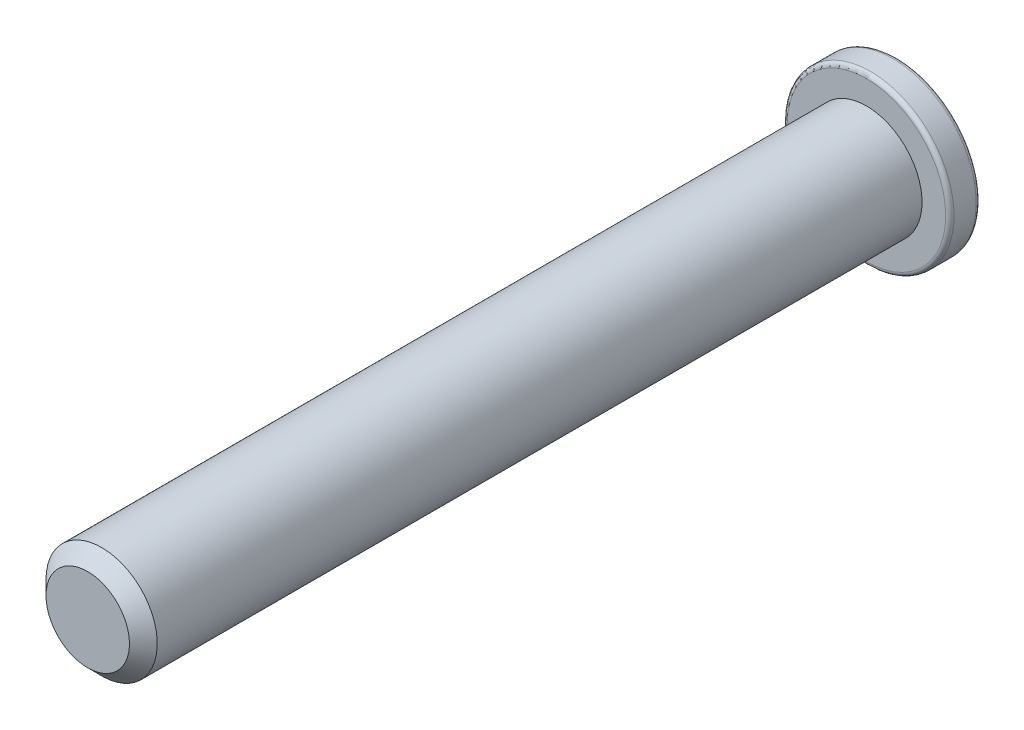
ISO-10303-21;
HEADER;
FILE_DESCRIPTION(('STEP AP214'),'2;1');
FILE_NAME('part.step','',(''),(''),'','','');
FILE_SCHEMA(('AUTOMOTIVE_DESIGN { 1 0 10303 214 1 1 1 1 }'));
ENDSEC;
DATA;
#1=APPLICATION_CONTEXT('core data for automotive mechanical design processes');
#2=APPLICATION_PROTOCOL_DEFINITION('international standard','automotive_design',2000,#1);
#3=PRODUCT_CONTEXT('',#1,'mechanical');
#4=PRODUCT('Part','Part','',(#3));
#5=PRODUCT_RELATED_PRODUCT_CATEGORY('part','',(#4));
#6=PRODUCT_DEFINITION_FORMATION('','',#4);
#7=PRODUCT_DEFINITION_CONTEXT('part definition',#1,'design');
#8=PRODUCT_DEFINITION('design','',#6,#7);
#9=PRODUCT_DEFINITION_SHAPE('','',#8);
#10=(LENGTH_UNIT() NAMED_UNIT(*) SI_UNIT(.MILLI.,.METRE.));
#11=(NAMED_UNIT(*) PLANE_ANGLE_UNIT() SI_UNIT($,.RADIAN.));
#12=(NAMED_UNIT(*) SI_UNIT($,.STERADIAN.) SOLID_ANGLE_UNIT());
#13=UNCERTAINTY_MEASURE_WITH_UNIT(LENGTH_MEASURE(1.E-05),#10,'distance_accuracy_value','');
#14=(GEOMETRIC_REPRESENTATION_CONTEXT(3) GLOBAL_UNCERTAINTY_ASSIGNED_CONTEXT((#13)) GLOBAL_UNIT_ASSIGNED_CONTEXT((#10,
#11,#12)) REPRESENTATION_CONTEXT('',''));
#15=CARTESIAN_POINT('',(0.,0.,0.));
#16=DIRECTION('',(0.,0.,1.));
#17=DIRECTION('',(1.,0.,0.));
#18=AXIS2_PLACEMENT_3D('',#15,#16,#17);
#19=CARTESIAN_POINT('',(12.09999928,11.25,-18.9584026755113));
#20=DIRECTION('',(-0.923879532511287,0.,-0.38268343236509));
#21=DIRECTION('',(-0.38268343236509,0.,0.923879532511287));
#22=AXIS2_PLACEMENT_3D('',#19,#20,#21);
#23=PLANE('',#22);
#24=DIRECTION('',(0.,1.,0.));
#25=VECTOR('',#24,1.);
#26=CARTESIAN_POINT('',(11.6029430051523,11.25,-17.7584026755113));
#27=LINE('',#26,#25);
#28=CARTESIAN_POINT('',(11.6029430051523,11.1339121743322,-17.7584026755113));
#29=VERTEX_POINT('',#28);
#30=CARTESIAN_POINT('',(11.6029430051523,11.3660878256678,-17.7584026755113));
#31=VERTEX_POINT('',#30);
#32=EDGE_CURVE('E117',#29,#31,#27,.T.);
#33=ORIENTED_EDGE('',*,*,#32,.T.);
#34=DIRECTION('',(-0.381887326256781,-0.0644695530821724,0.921957562347547));
#35=VECTOR('',#34,1.);
#36=CARTESIAN_POINT('',(12.09999928,11.45,-18.9584026755113));
#37=LINE('',#36,#35);
#38=CARTESIAN_POINT('',(12.09999928,11.45,-18.9584026755113));
#39=VERTEX_POINT('',#38);
#40=EDGE_CURVE('E133',#39,#31,#37,.T.);
#41=ORIENTED_EDGE('',*,*,#40,.F.);
#42=DIRECTION('',(0.,1.,0.));
#43=VECTOR('',#42,1.);
#44=CARTESIAN_POINT('',(12.09999928,11.25,-18.9584026755113));
#45=LINE('',#44,#43);
#46=CARTESIAN_POINT('',(12.09999928,11.05,-18.9584026755113));
#47=VERTEX_POINT('',#46);
#48=EDGE_CURVE('E122',#39,#47,#45,.F.);
#49=ORIENTED_EDGE('',*,*,#48,.T.);
#50=DIRECTION('',(0.381887326256781,-0.0644695530821737,-0.921957562347547));
#51=VECTOR('',#50,1.);
#52=CARTESIAN_POINT('',(11.6029430051523,11.1339121743322,-17.7584026755113));
#53=LINE('',#52,#51);
#54=EDGE_CURVE('E286',#29,#47,#53,.T.);
#55=ORIENTED_EDGE('',*,*,#54,.F.);
#56=EDGE_LOOP('',(#33,#41,#49,#55));
#57=FACE_BOUND('',#56,.T.);
#58=ADVANCED_FACE('F17',(#57),#23,.T.);
#59=CARTESIAN_POINT('',(11.24999928,11.45,-18.9584026755113));
#60=DIRECTION('',(0.,-0.997564050259824,-0.0697564737441253));
#61=DIRECTION('',(0.,0.0697564737441253,-0.997564050259824));
#62=AXIS2_PLACEMENT_3D('',#59,#60,#61);
#63=PLANE('',#62);
#64=DIRECTION('',(1.,0.,0.));
#65=VECTOR('',#64,1.);
#66=CARTESIAN_POINT('',(11.24999928,11.3660878256678,-17.7584026755113));
#67=LINE('',#66,#65);
#68=CARTESIAN_POINT('',(11.3660871056678,11.3660878256678,-17.7584026755113));
#69=VERTEX_POINT('',#68);
#70=EDGE_CURVE('E135',#31,#69,#67,.F.);
#71=ORIENTED_EDGE('',*,*,#70,.T.);
#72=DIRECTION('',(-0.0695873743166642,-0.0695873743166541,0.995145815783509));
#73=VECTOR('',#72,1.);
#74=CARTESIAN_POINT('',(11.44999928,11.45,-18.9584026755113));
#75=LINE('',#74,#73);
#76=CARTESIAN_POINT('',(11.44999928,11.45,-18.9584026755113));
#77=VERTEX_POINT('',#76);
#78=EDGE_CURVE('E139',#77,#69,#75,.T.);
#79=ORIENTED_EDGE('',*,*,#78,.F.);
#80=DIRECTION('',(1.,0.,0.));
#81=VECTOR('',#80,1.);
#82=CARTESIAN_POINT('',(11.24999928,11.45,-18.9584026755113));
#83=LINE('',#82,#81);
#84=EDGE_CURVE('E126',#77,#39,#83,.T.);
#85=ORIENTED_EDGE('',*,*,#84,.T.);
#86=ORIENTED_EDGE('',*,*,#40,.T.);
#87=EDGE_LOOP('',(#71,#79,#85,#86));
#88=FACE_BOUND('',#87,.T.);
#89=ADVANCED_FACE('F137',(#88),#63,.T.);
#90=CARTESIAN_POINT('',(11.24999928,11.05,-18.9584026755113));
#91=DIRECTION('',(0.,0.997564050259824,-0.0697564737441253));
#92=DIRECTION('',(0.,0.0697564737441253,0.997564050259824));
#93=AXIS2_PLACEMENT_3D('',#90,#91,#92);
#94=PLANE('',#93);
#95=DIRECTION('',(1.,0.,0.));
#96=VECTOR('',#95,1.);
#97=CARTESIAN_POINT('',(11.24999928,11.1339121743322,-17.7584026755113));
#98=LINE('',#97,#96);
#99=CARTESIAN_POINT('',(11.3660871056678,11.1339121743322,-17.7584026755113));
#100=VERTEX_POINT('',#99);
#101=EDGE_CURVE('E288',#100,#29,#98,.T.);
#102=ORIENTED_EDGE('',*,*,#101,.T.);
#103=ORIENTED_EDGE('',*,*,#54,.T.);
#104=DIRECTION('',(1.,0.,0.));
#105=VECTOR('',#104,1.);
#106=CARTESIAN_POINT('',(11.24999928,11.05,-18.9584026755113));
#107=LINE('',#106,#105);
#108=CARTESIAN_POINT('',(11.44999928,11.05,-18.9584026755113));
#109=VERTEX_POINT('',#108);
#110=EDGE_CURVE('E129',#47,#109,#107,.F.);
#111=ORIENTED_EDGE('',*,*,#110,.T.);
#112=DIRECTION('',(0.0695873743166642,-0.0695873743166541,-0.995145815783509));
#113=VECTOR('',#112,1.);
#114=CARTESIAN_POINT('',(11.3660871056678,11.1339121743322,-17.7584026755113));
#115=LINE('',#114,#113);
#116=EDGE_CURVE('E272',#100,#109,#115,.T.);
#117=ORIENTED_EDGE('',*,*,#116,.F.);
#118=EDGE_LOOP('',(#102,#103,#111,#117));
#119=FACE_BOUND('',#118,.T.);
#120=ADVANCED_FACE('F459',(#119),#94,.T.);
#121=CARTESIAN_POINT('',(11.44999928,11.25,-18.9584026755113));
#122=DIRECTION('',(-0.997564050259824,0.,-0.0697564737441253));
#123=DIRECTION('',(-0.0697564737441253,0.,0.997564050259824));
#124=AXIS2_PLACEMENT_3D('',#121,#122,#123);
#125=PLANE('',#124);
#126=DIRECTION('',(0.,1.,0.));
#127=VECTOR('',#126,1.);
#128=CARTESIAN_POINT('',(11.3660871056678,11.25,-17.7584026755113));
#129=LINE('',#128,#127);
#130=CARTESIAN_POINT('',(11.3660871056678,11.6029437251523,-17.7584026755113));
#131=VERTEX_POINT('',#130);
#132=EDGE_CURVE('E281',#69,#131,#129,.T.);
#133=ORIENTED_EDGE('',*,*,#132,.T.);
#134=DIRECTION('',(-0.0644695530821645,-0.381887326256792,0.921957562347544));
#135=VECTOR('',#134,1.);
#136=CARTESIAN_POINT('',(11.44999928,12.1,-18.9584026755113));
#137=LINE('',#136,#135);
#138=CARTESIAN_POINT('',(11.44999928,12.1,-18.9584026755113));
#139=VERTEX_POINT('',#138);
#140=EDGE_CURVE('E266',#139,#131,#137,.T.);
#141=ORIENTED_EDGE('',*,*,#140,.F.);
#142=DIRECTION('',(0.,1.,0.));
#143=VECTOR('',#142,1.);
#144=CARTESIAN_POINT('',(11.44999928,11.25,-18.9584026755113));
#145=LINE('',#144,#143);
#146=EDGE_CURVE('E284',#139,#77,#145,.F.);
#147=ORIENTED_EDGE('',*,*,#146,.T.);
#148=ORIENTED_EDGE('',*,*,#78,.T.);
#149=EDGE_LOOP('',(#133,#141,#147,#148));
#150=FACE_BOUND('',#149,.T.);
#151=ADVANCED_FACE('F298',(#150),#125,.T.);
#152=CARTESIAN_POINT('',(11.44999928,11.25,-18.9584026755113));
#153=DIRECTION('',(-0.997564050259824,0.,-0.0697564737441253));
#154=DIRECTION('',(-0.0697564737441253,0.,0.997564050259824));
#155=AXIS2_PLACEMENT_3D('',#152,#153,#154);
#156=PLANE('',#155);
#157=DIRECTION('',(0.,1.,0.));
#158=VECTOR('',#157,1.);
#159=CARTESIAN_POINT('',(11.3660871056678,11.25,-17.7584026755113));
#160=LINE('',#159,#158);
#161=CARTESIAN_POINT('',(11.3660871056678,10.8970562748477,-17.7584026755113));
#162=VERTEX_POINT('',#161);
#163=EDGE_CURVE('E275',#162,#100,#160,.T.);
#164=ORIENTED_EDGE('',*,*,#163,.T.);
#165=ORIENTED_EDGE('',*,*,#116,.T.);
#166=DIRECTION('',(0.,1.,0.));
#167=VECTOR('',#166,1.);
#168=CARTESIAN_POINT('',(11.44999928,11.25,-18.9584026755113));
#169=LINE('',#168,#167);
#170=CARTESIAN_POINT('',(11.44999928,10.4,-18.9584026755113));
#171=VERTEX_POINT('',#170);
#172=EDGE_CURVE('E278',#109,#171,#169,.F.);
#173=ORIENTED_EDGE('',*,*,#172,.T.);
#174=DIRECTION('',(0.0644695530821645,-0.381887326256792,-0.921957562347544));
#175=VECTOR('',#174,1.);
#176=CARTESIAN_POINT('',(11.3660871056678,10.8970562748477,-17.7584026755113));
#177=LINE('',#176,#175);
#178=EDGE_CURVE('E255',#162,#171,#177,.T.);
#179=ORIENTED_EDGE('',*,*,#178,.F.);
#180=EDGE_LOOP('',(#164,#165,#173,#179));
#181=FACE_BOUND('',#180,.T.);
#182=ADVANCED_FACE('F445',(#181),#156,.T.);
#183=CARTESIAN_POINT('',(11.24999928,12.1,-18.9584026755113));
#184=DIRECTION('',(0.,-0.923879532511287,-0.38268343236509));
#185=DIRECTION('',(0.,0.38268343236509,-0.923879532511287));
#186=AXIS2_PLACEMENT_3D('',#183,#184,#185);
#187=PLANE('',#186);
#188=DIRECTION('',(1.,0.,0.));
#189=VECTOR('',#188,1.);
#190=CARTESIAN_POINT('',(11.24999928,11.6029437251523,-17.7584026755113));
#191=LINE('',#190,#189);
#192=CARTESIAN_POINT('',(11.1339114543322,11.6029437251523,-17.7584026755113));
#193=VERTEX_POINT('',#192);
#194=EDGE_CURVE('E264',#131,#193,#191,.F.);
#195=ORIENTED_EDGE('',*,*,#194,.T.);
#196=DIRECTION('',(0.0644695530821724,-0.38188732625678,0.921957562347548));
#197=VECTOR('',#196,1.);
#198=CARTESIAN_POINT('',(11.04999928,12.1,-18.9584026755113));
#199=LINE('',#198,#197);
#200=CARTESIAN_POINT('',(11.04999928,12.1,-18.9584026755113));
#201=VERTEX_POINT('',#200);
#202=EDGE_CURVE('E249',#201,#193,#199,.T.);
#203=ORIENTED_EDGE('',*,*,#202,.F.);
#204=DIRECTION('',(1.,0.,0.));
#205=VECTOR('',#204,1.);
#206=CARTESIAN_POINT('',(11.24999928,12.1,-18.9584026755113));
#207=LINE('',#206,#205);
#208=EDGE_CURVE('E269',#201,#139,#207,.T.);
#209=ORIENTED_EDGE('',*,*,#208,.T.);
#210=ORIENTED_EDGE('',*,*,#140,.T.);
#211=EDGE_LOOP('',(#195,#203,#209,#210));
#212=FACE_BOUND('',#211,.T.);
#213=ADVANCED_FACE('F302',(#212),#187,.T.);
#214=CARTESIAN_POINT('',(11.24999928,10.4,-18.9584026755113));
#215=DIRECTION('',(0.,0.923879532511287,-0.38268343236509));
#216=DIRECTION('',(0.,0.38268343236509,0.923879532511287));
#217=AXIS2_PLACEMENT_3D('',#214,#215,#216);
#218=PLANE('',#217);
#219=DIRECTION('',(1.,0.,0.));
#220=VECTOR('',#219,1.);
#221=CARTESIAN_POINT('',(11.24999928,10.8970562748477,-17.7584026755113));
#222=LINE('',#221,#220);
#223=CARTESIAN_POINT('',(11.1339114543322,10.8970562748477,-17.7584026755113));
#224=VERTEX_POINT('',#223);
#225=EDGE_CURVE('E258',#224,#162,#222,.T.);
#226=ORIENTED_EDGE('',*,*,#225,.T.);
#227=ORIENTED_EDGE('',*,*,#178,.T.);
#228=DIRECTION('',(1.,0.,0.));
#229=VECTOR('',#228,1.);
#230=CARTESIAN_POINT('',(11.24999928,10.4,-18.9584026755113));
#231=LINE('',#230,#229);
#232=CARTESIAN_POINT('',(11.04999928,10.4,-18.9584026755113));
#233=VERTEX_POINT('',#232);
#234=EDGE_CURVE('E261',#171,#233,#231,.F.);
#235=ORIENTED_EDGE('',*,*,#234,.T.);
#236=DIRECTION('',(-0.0644695530821738,-0.381887326256779,-0.921957562347548));
#237=VECTOR('',#236,1.);
#238=CARTESIAN_POINT('',(11.1339114543322,10.8970562748477,-17.7584026755113));
#239=LINE('',#238,#237);
#240=EDGE_CURVE('E241',#224,#233,#239,.T.);
#241=ORIENTED_EDGE('',*,*,#240,.F.);
#242=EDGE_LOOP('',(#226,#227,#235,#241));
#243=FACE_BOUND('',#242,.T.);
#244=ADVANCED_FACE('F431',(#243),#218,.T.);
#245=CARTESIAN_POINT('',(11.04999928,11.25,-18.9584026755113));
#246=DIRECTION('',(0.997564050259824,0.,-0.0697564737441253));
#247=DIRECTION('',(-0.0697564737441253,0.,-0.997564050259824));
#248=AXIS2_PLACEMENT_3D('',#245,#246,#247);
#249=PLANE('',#248);
#250=DIRECTION('',(0.,1.,0.));
#251=VECTOR('',#250,1.);
#252=CARTESIAN_POINT('',(11.1339114543322,11.25,-17.7584026755113));
#253=LINE('',#252,#251);
#254=CARTESIAN_POINT('',(11.1339114543322,11.3660878256678,-17.7584026755113));
#255=VERTEX_POINT('',#254);
#256=EDGE_CURVE('E247',#193,#255,#253,.F.);
#257=ORIENTED_EDGE('',*,*,#256,.T.);
#258=DIRECTION('',(0.0695873743166541,-0.0695873743166642,0.995145815783509));
#259=VECTOR('',#258,1.);
#260=CARTESIAN_POINT('',(11.04999928,11.45,-18.9584026755113));
#261=LINE('',#260,#259);
#262=CARTESIAN_POINT('',(11.04999928,11.45,-18.9584026755113));
#263=VERTEX_POINT('',#262);
#264=EDGE_CURVE('E235',#263,#255,#261,.T.);
#265=ORIENTED_EDGE('',*,*,#264,.F.);
#266=DIRECTION('',(0.,1.,0.));
#267=VECTOR('',#266,1.);
#268=CARTESIAN_POINT('',(11.04999928,11.25,-18.9584026755113));
#269=LINE('',#268,#267);
#270=EDGE_CURVE('E252',#263,#201,#269,.T.);
#271=ORIENTED_EDGE('',*,*,#270,.T.);
#272=ORIENTED_EDGE('',*,*,#202,.T.);
#273=EDGE_LOOP('',(#257,#265,#271,#272));
#274=FACE_BOUND('',#273,.T.);
#275=ADVANCED_FACE('F304',(#274),#249,.T.);
#276=CARTESIAN_POINT('',(11.04999928,11.25,-18.9584026755113));
#277=DIRECTION('',(0.997564050259824,0.,-0.0697564737441253));
#278=DIRECTION('',(-0.0697564737441253,0.,-0.997564050259824));
#279=AXIS2_PLACEMENT_3D('',#276,#277,#278);
#280=PLANE('',#279);
#281=DIRECTION('',(0.,1.,0.));
#282=VECTOR('',#281,1.);
#283=CARTESIAN_POINT('',(11.1339114543322,11.25,-17.7584026755113));
#284=LINE('',#283,#282);
#285=CARTESIAN_POINT('',(11.1339114543322,11.1339121743322,-17.7584026755113));
#286=VERTEX_POINT('',#285);
#287=EDGE_CURVE('E230',#224,#286,#284,.T.);
#288=ORIENTED_EDGE('',*,*,#287,.F.);
#289=ORIENTED_EDGE('',*,*,#240,.T.);
#290=DIRECTION('',(0.,1.,0.));
#291=VECTOR('',#290,1.);
#292=CARTESIAN_POINT('',(11.04999928,11.25,-18.9584026755113));
#293=LINE('',#292,#291);
#294=CARTESIAN_POINT('',(11.04999928,11.05,-18.9584026755113));
#295=VERTEX_POINT('',#294);
#296=EDGE_CURVE('E244',#233,#295,#293,.T.);
#297=ORIENTED_EDGE('',*,*,#296,.T.);
#298=DIRECTION('',(-0.0695873743166541,-0.0695873743166642,-0.995145815783509));
#299=VECTOR('',#298,1.);
#300=CARTESIAN_POINT('',(11.1339114543322,11.1339121743322,-17.7584026755113));
#301=LINE('',#300,#299);
#302=EDGE_CURVE('E222',#286,#295,#301,.T.);
#303=ORIENTED_EDGE('',*,*,#302,.F.);
#304=EDGE_LOOP('',(#288,#289,#297,#303));
#305=FACE_BOUND('',#304,.T.);
#306=ADVANCED_FACE('F417',(#305),#280,.T.);
#307=CARTESIAN_POINT('',(11.24999928,11.45,-18.9584026755113));
#308=DIRECTION('',(0.,-0.997564050259824,-0.0697564737441253));
#309=DIRECTION('',(0.,0.0697564737441253,-0.997564050259824));
#310=AXIS2_PLACEMENT_3D('',#307,#308,#309);
#311=PLANE('',#310);
#312=DIRECTION('',(-1.,0.,0.));
#313=VECTOR('',#312,1.);
#314=CARTESIAN_POINT('',(11.24999928,11.3660878256678,-17.7584026755113));
#315=LINE('',#314,#313);
#316=CARTESIAN_POINT('',(10.8970555548477,11.3660878256678,-17.7584026755113));
#317=VERTEX_POINT('',#316);
#318=EDGE_CURVE('E232',#317,#255,#315,.F.);
#319=ORIENTED_EDGE('',*,*,#318,.F.);
#320=DIRECTION('',(0.381887326256791,-0.0644695530821644,0.921957562347544));
#321=VECTOR('',#320,1.);
#322=CARTESIAN_POINT('',(10.39999928,11.45,-18.9584026755113));
#323=LINE('',#322,#321);
#324=CARTESIAN_POINT('',(10.39999928,11.45,-18.9584026755113));
#325=VERTEX_POINT('',#324);
#326=EDGE_CURVE('E219',#325,#317,#323,.T.);
#327=ORIENTED_EDGE('',*,*,#326,.F.);
#328=DIRECTION('',(1.,0.,0.));
#329=VECTOR('',#328,1.);
#330=CARTESIAN_POINT('',(11.24999928,11.45,-18.9584026755113));
#331=LINE('',#330,#329);
#332=EDGE_CURVE('E238',#325,#263,#331,.T.);
#333=ORIENTED_EDGE('',*,*,#332,.T.);
#334=ORIENTED_EDGE('',*,*,#264,.T.);
#335=EDGE_LOOP('',(#319,#327,#333,#334));
#336=FACE_BOUND('',#335,.T.);
#337=ADVANCED_FACE('F307',(#336),#311,.T.);
#338=CARTESIAN_POINT('',(11.24999928,11.25,-17.7584026755113));
#339=DIRECTION('',(0.,0.,-1.));
#340=DIRECTION('',(-1.,0.,0.));
#341=AXIS2_PLACEMENT_3D('',#338,#339,#340);
#342=PLANE('',#341);
#343=ORIENTED_EDGE('',*,*,#225,.F.);
#344=ORIENTED_EDGE('',*,*,#287,.T.);
#345=DIRECTION('',(1.,0.,0.));
#346=VECTOR('',#345,1.);
#347=CARTESIAN_POINT('',(11.24999928,11.1339121743322,-17.7584026755113));
#348=LINE('',#347,#346);
#349=CARTESIAN_POINT('',(10.8970555548477,11.1339121743322,-17.7584026755113));
#350=VERTEX_POINT('',#349);
#351=EDGE_CURVE('E225',#350,#286,#348,.T.);
#352=ORIENTED_EDGE('',*,*,#351,.F.);
#353=DIRECTION('',(0.,1.,0.));
#354=VECTOR('',#353,1.);
#355=CARTESIAN_POINT('',(10.8970555548477,11.25,-17.7584026755113));
#356=LINE('',#355,#354);
#357=EDGE_CURVE('E216',#317,#350,#356,.F.);
#358=ORIENTED_EDGE('',*,*,#357,.F.);
#359=ORIENTED_EDGE('',*,*,#318,.T.);
#360=ORIENTED_EDGE('',*,*,#256,.F.);
#361=ORIENTED_EDGE('',*,*,#194,.F.);
#362=ORIENTED_EDGE('',*,*,#132,.F.);
#363=ORIENTED_EDGE('',*,*,#70,.F.);
#364=ORIENTED_EDGE('',*,*,#32,.F.);
#365=ORIENTED_EDGE('',*,*,#101,.F.);
#366=ORIENTED_EDGE('',*,*,#163,.F.);
#367=EDGE_LOOP('',(#343,#344,#352,#358,#359,#360,#361,#362,#363,#364,#365,#366));
#368=FACE_BOUND('',#367,.T.);
#369=ADVANCED_FACE('F294',(#368),#342,.T.);
#370=CARTESIAN_POINT('',(11.24999928,11.05,-18.9584026755113));
#371=DIRECTION('',(0.,0.997564050259824,-0.0697564737441253));
#372=DIRECTION('',(0.,0.0697564737441253,0.997564050259824));
#373=AXIS2_PLACEMENT_3D('',#370,#371,#372);
#374=PLANE('',#373);
#375=ORIENTED_EDGE('',*,*,#351,.T.);
#376=ORIENTED_EDGE('',*,*,#302,.T.);
#377=DIRECTION('',(1.,0.,0.));
#378=VECTOR('',#377,1.);
#379=CARTESIAN_POINT('',(11.24999928,11.05,-18.9584026755113));
#380=LINE('',#379,#378);
#381=CARTESIAN_POINT('',(10.39999928,11.05,-18.9584026755113));
#382=VERTEX_POINT('',#381);
#383=EDGE_CURVE('E228',#295,#382,#380,.F.);
#384=ORIENTED_EDGE('',*,*,#383,.T.);
#385=DIRECTION('',(-0.381887326256791,-0.0644695530821644,-0.921957562347544));
#386=VECTOR('',#385,1.);
#387=CARTESIAN_POINT('',(10.8970555548477,11.1339121743322,-17.7584026755113));
#388=LINE('',#387,#386);
#389=EDGE_CURVE('E207',#350,#382,#388,.T.);
#390=ORIENTED_EDGE('',*,*,#389,.F.);
#391=EDGE_LOOP('',(#375,#376,#384,#390));
#392=FACE_BOUND('',#391,.T.);
#393=ADVANCED_FACE('F336',(#392),#374,.T.);
#394=CARTESIAN_POINT('',(10.39999928,11.25,-18.9584026755113));
#395=DIRECTION('',(0.923879532511287,0.,-0.38268343236509));
#396=DIRECTION('',(-0.38268343236509,0.,-0.923879532511287));
#397=AXIS2_PLACEMENT_3D('',#394,#395,#396);
#398=PLANE('',#397);
#399=ORIENTED_EDGE('',*,*,#357,.T.);
#400=ORIENTED_EDGE('',*,*,#389,.T.);
#401=DIRECTION('',(0.,1.,0.));
#402=VECTOR('',#401,1.);
#403=CARTESIAN_POINT('',(10.39999928,11.25,-18.9584026755113));
#404=LINE('',#403,#402);
#405=EDGE_CURVE('E215',#382,#325,#404,.T.);
#406=ORIENTED_EDGE('',*,*,#405,.T.);
#407=ORIENTED_EDGE('',*,*,#326,.T.);
#408=EDGE_LOOP('',(#399,#400,#406,#407));
#409=FACE_BOUND('',#408,.T.);
#410=ADVANCED_FACE('F331',(#409),#398,.T.);
#411=CARTESIAN_POINT('',(11.24999928,11.25,-18.9584026755113));
#412=DIRECTION('',(0.,0.,1.));
#413=DIRECTION('',(1.,0.,0.));
#414=AXIS2_PLACEMENT_3D('',#411,#412,#413);
#415=PLANE('',#414);
#416=ORIENTED_EDGE('',*,*,#383,.F.);
#417=ORIENTED_EDGE('',*,*,#296,.F.);
#418=ORIENTED_EDGE('',*,*,#234,.F.);
#419=ORIENTED_EDGE('',*,*,#172,.F.);
#420=ORIENTED_EDGE('',*,*,#110,.F.);
#421=ORIENTED_EDGE('',*,*,#48,.F.);
#422=ORIENTED_EDGE('',*,*,#84,.F.);
#423=ORIENTED_EDGE('',*,*,#146,.F.);
#424=ORIENTED_EDGE('',*,*,#208,.F.);
#425=ORIENTED_EDGE('',*,*,#270,.F.);
#426=ORIENTED_EDGE('',*,*,#332,.F.);
#427=ORIENTED_EDGE('',*,*,#405,.F.);
#428=EDGE_LOOP('',(#416,#417,#418,#419,#420,#421,#422,#423,#424,#425,#426,#427));
#429=FACE_BOUND('',#428,.T.);
#430=CARTESIAN_POINT('',(11.24999928,11.25,-18.9584026755113));
#431=DIRECTION('',(0.,0.,1.));
#432=DIRECTION('',(-1.,0.,0.));
#433=AXIS2_PLACEMENT_3D('',#430,#431,#432);
#434=CIRCLE('',#433,1.425);
#435=CARTESIAN_POINT('',(9.82499928,11.25,-18.9584026755113));
#436=VERTEX_POINT('',#435);
#437=CARTESIAN_POINT('',(12.67499928,11.25,-18.9584026755113));
#438=VERTEX_POINT('',#437);
#439=EDGE_CURVE('E311',#436,#438,#434,.T.);
#440=ORIENTED_EDGE('',*,*,#439,.F.);
#441=CARTESIAN_POINT('',(11.24999928,11.25,-18.9584026755113));
#442=DIRECTION('',(0.,0.,1.));
#443=DIRECTION('',(1.,0.,0.));
#444=AXIS2_PLACEMENT_3D('',#441,#442,#443);
#445=CIRCLE('',#444,1.425);
#446=EDGE_CURVE('E187',#438,#436,#445,.T.);
#447=ORIENTED_EDGE('',*,*,#446,.F.);
#448=EDGE_LOOP('',(#440,#447));
#449=FACE_BOUND('',#448,.T.);
#450=ADVANCED_FACE('F123',(#429,#449),#415,.F.);
#451=CARTESIAN_POINT('',(11.24999928,11.25,-18.8834026755113));
#452=DIRECTION('',(0.,0.,1.));
#453=DIRECTION('',(-1.,0.,0.));
#454=AXIS2_PLACEMENT_3D('',#451,#452,#453);
#455=TOROIDAL_SURFACE('',#454,1.425,0.075);
#456=CARTESIAN_POINT('',(11.24999928,11.25,-18.8834026755113));
#457=DIRECTION('',(0.,0.,-1.));
#458=DIRECTION('',(-1.,0.,0.));
#459=AXIS2_PLACEMENT_3D('',#456,#457,#458);
#460=CIRCLE('',#459,1.5);
#461=CARTESIAN_POINT('',(9.74999928,11.25,-18.8834026755113));
#462=VERTEX_POINT('',#461);
#463=EDGE_CURVE('E184',#462,#462,#460,.F.);
#464=ORIENTED_EDGE('',*,*,#463,.F.);
#465=EDGE_LOOP('',(#464));
#466=FACE_BOUND('',#465,.T.);
#467=ORIENTED_EDGE('',*,*,#446,.T.);
#468=ORIENTED_EDGE('',*,*,#439,.T.);
#469=EDGE_LOOP('',(#467,#468));
#470=FACE_BOUND('',#469,.T.);
#471=ADVANCED_FACE('F191',(#466,#470),#455,.T.);
#472=CARTESIAN_POINT('',(11.24999928,11.25,-18.4084026755113));
#473=DIRECTION('',(0.,0.,-1.));
#474=DIRECTION('',(-1.,0.,0.));
#475=AXIS2_PLACEMENT_3D('',#472,#473,#474);
#476=CYLINDRICAL_SURFACE('',#475,1.5);
#477=ORIENTED_EDGE('',*,*,#463,.T.);
#478=EDGE_LOOP('',(#477));
#479=FACE_BOUND('',#478,.T.);
#480=CARTESIAN_POINT('',(11.24999928,11.25,-18.4834026755113));
#481=DIRECTION('',(0.,0.,1.));
#482=DIRECTION('',(-1.,0.,0.));
#483=AXIS2_PLACEMENT_3D('',#480,#481,#482);
#484=CIRCLE('',#483,1.5);
#485=CARTESIAN_POINT('',(9.74999928,11.25,-18.4834026755113));
#486=VERTEX_POINT('',#485);
#487=EDGE_CURVE('E149',#486,#486,#484,.T.);
#488=ORIENTED_EDGE('',*,*,#487,.F.);
#489=EDGE_LOOP('',(#488));
#490=FACE_BOUND('',#489,.T.);
#491=ADVANCED_FACE('F195',(#479,#490),#476,.T.);
#492=CARTESIAN_POINT('',(11.24999928,11.25,-4.40840267551127));
#493=DIRECTION('',(0.,0.,1.));
#494=DIRECTION('',(1.,0.,0.));
#495=AXIS2_PLACEMENT_3D('',#492,#493,#494);
#496=PLANE('',#495);
#497=CARTESIAN_POINT('',(11.24999928,11.25,-4.40840267549447));
#498=DIRECTION('',(0.,0.,-1.));
#499=DIRECTION('',(-1.,0.,0.));
#500=AXIS2_PLACEMENT_3D('',#497,#498,#499);
#501=CIRCLE('',#500,0.749999999964867);
#502=CARTESIAN_POINT('',(10.4999992800351,11.25,-4.40840267549447));
#503=VERTEX_POINT('',#502);
#504=EDGE_CURVE('E145',#503,#503,#501,.T.);
#505=ORIENTED_EDGE('',*,*,#504,.F.);
#506=EDGE_LOOP('',(#505));
#507=FACE_BOUND('',#506,.T.);
#508=ADVANCED_FACE('F166',(#507),#496,.T.);
#509=CARTESIAN_POINT('',(11.24999928,11.25,-18.4834026755113));
#510=DIRECTION('',(0.,0.,1.));
#511=DIRECTION('',(-1.,0.,0.));
#512=AXIS2_PLACEMENT_3D('',#509,#510,#511);
#513=TOROIDAL_SURFACE('',#512,1.425,0.075);
#514=CARTESIAN_POINT('',(11.24999928,11.25,-18.4084026755113));
#515=DIRECTION('',(0.,0.,-1.));
#516=DIRECTION('',(1.,0.,0.));
#517=AXIS2_PLACEMENT_3D('',#514,#515,#516);
#518=CIRCLE('',#517,1.425);
#519=CARTESIAN_POINT('',(9.82499928,11.25,-18.4084026755113));
#520=VERTEX_POINT('',#519);
#521=CARTESIAN_POINT('',(12.67499928,11.25,-18.4084026755113));
#522=VERTEX_POINT('',#521);
#523=EDGE_CURVE('E148',#520,#522,#518,.F.);
#524=ORIENTED_EDGE('',*,*,#523,.F.);
#525=CARTESIAN_POINT('',(11.24999928,11.25,-18.4084026755113));
#526=DIRECTION('',(0.,0.,-1.));
#527=DIRECTION('',(-1.,0.,0.));
#528=AXIS2_PLACEMENT_3D('',#525,#526,#527);
#529=CIRCLE('',#528,1.425);
#530=EDGE_CURVE('E36',#522,#520,#529,.F.);
#531=ORIENTED_EDGE('',*,*,#530,.F.);
#532=EDGE_LOOP('',(#524,#531));
#533=FACE_BOUND('',#532,.T.);
#534=ORIENTED_EDGE('',*,*,#487,.T.);
#535=EDGE_LOOP('',(#534));
#536=FACE_BOUND('',#535,.T.);
#537=ADVANCED_FACE('F154',(#533,#536),#513,.T.);
#538=CARTESIAN_POINT('',(11.24999928,11.25,-4.65840267577278));
#539=DIRECTION('',(0.,0.,-1.));
#540=DIRECTION('',(-1.,0.,0.));
#541=AXIS2_PLACEMENT_3D('',#538,#539,#540);
#542=CONICAL_SURFACE('',#541,0.999999999788425,0.785398162487954);
#543=ORIENTED_EDGE('',*,*,#504,.T.);
#544=EDGE_LOOP('',(#543));
#545=FACE_BOUND('',#544,.T.);
#546=CARTESIAN_POINT('',(11.24999928,11.25,-4.65840267551127));
#547=DIRECTION('',(0.,0.,-1.));
#548=DIRECTION('',(-1.,0.,0.));
#549=AXIS2_PLACEMENT_3D('',#546,#547,#548);
#550=CIRCLE('',#549,1.);
#551=CARTESIAN_POINT('',(10.24999928,11.25,-4.65840267551127));
#552=VERTEX_POINT('',#551);
#553=EDGE_CURVE('E28',#552,#552,#550,.T.);
#554=ORIENTED_EDGE('',*,*,#553,.F.);
#555=EDGE_LOOP('',(#554));
#556=FACE_BOUND('',#555,.T.);
#557=ADVANCED_FACE('F165',(#545,#556),#542,.T.);
#558=CARTESIAN_POINT('',(11.24999928,11.25,-18.4084026755113));
#559=DIRECTION('',(0.,0.,1.));
#560=DIRECTION('',(1.,0.,0.));
#561=AXIS2_PLACEMENT_3D('',#558,#559,#560);
#562=PLANE('',#561);
#563=CARTESIAN_POINT('',(11.24999928,11.25,-18.4084026755113));
#564=DIRECTION('',(0.,0.,-1.));
#565=DIRECTION('',(-1.,0.,0.));
#566=AXIS2_PLACEMENT_3D('',#563,#564,#565);
#567=CIRCLE('',#566,1.);
#568=CARTESIAN_POINT('',(10.24999928,11.25,-18.4084026755113));
#569=VERTEX_POINT('',#568);
#570=EDGE_CURVE('E11',#569,#569,#567,.F.);
#571=ORIENTED_EDGE('',*,*,#570,.F.);
#572=EDGE_LOOP('',(#571));
#573=FACE_BOUND('',#572,.T.);
#574=ORIENTED_EDGE('',*,*,#523,.T.);
#575=ORIENTED_EDGE('',*,*,#530,.T.);
#576=EDGE_LOOP('',(#574,#575));
#577=FACE_BOUND('',#576,.T.);
#578=ADVANCED_FACE('F339',(#573,#577),#562,.T.);
#579=CARTESIAN_POINT('',(11.24999928,11.25,-4.40840267551127));
#580=DIRECTION('',(0.,0.,-1.));
#581=DIRECTION('',(-1.,0.,0.));
#582=AXIS2_PLACEMENT_3D('',#579,#580,#581);
#583=CYLINDRICAL_SURFACE('',#582,1.);
#584=ORIENTED_EDGE('',*,*,#553,.T.);
#585=EDGE_LOOP('',(#584));
#586=FACE_BOUND('',#585,.T.);
#587=ORIENTED_EDGE('',*,*,#570,.T.);
#588=EDGE_LOOP('',(#587));
#589=FACE_BOUND('',#588,.T.);
#590=ADVANCED_FACE('F337',(#586,#589),#583,.T.);
#591=CLOSED_SHELL('',(#58,#89,#120,#151,#182,#213,#244,#275,#306,#337,#369,#393,#410,#450,#471,
#491,#508,#537,#557,#578,#590));
#592=MANIFOLD_SOLID_BREP('B1',#591);
#593=ADVANCED_BREP_SHAPE_REPRESENTATION('',(#18,#592),#14);
#594=SHAPE_DEFINITION_REPRESENTATION(#9,#593);
ENDSEC;
END-ISO-10303-21;
